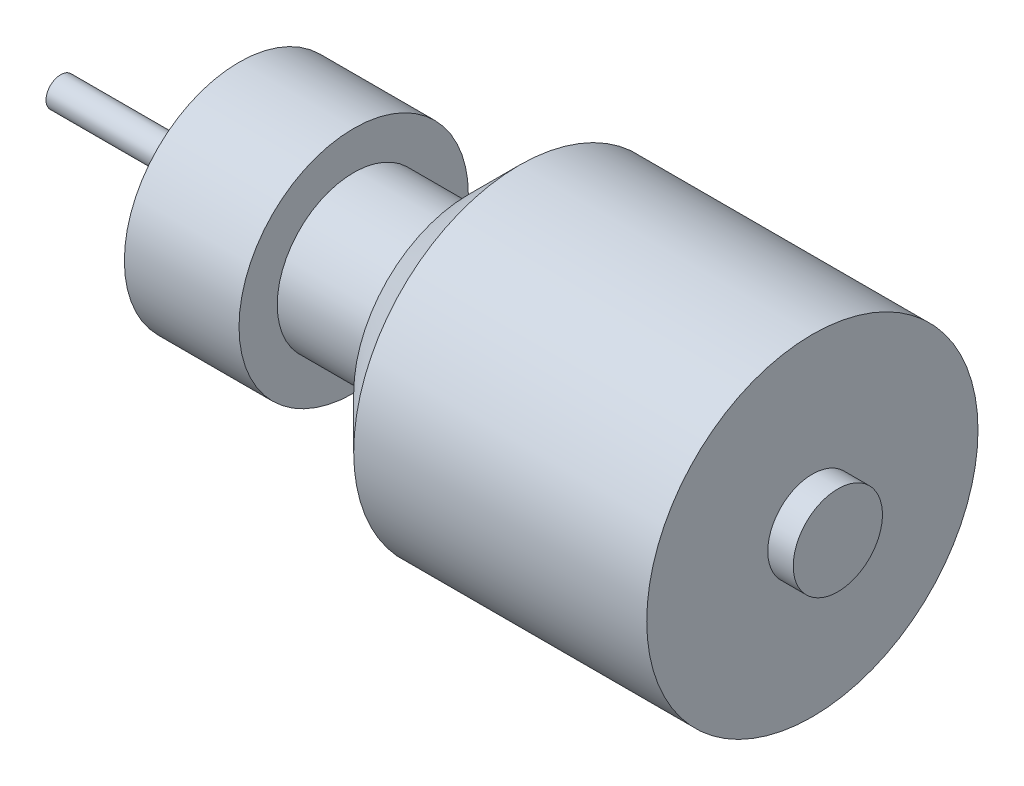
ISO-10303-21;
HEADER;
FILE_DESCRIPTION(('STEP AP214'),'2;1');
FILE_NAME('part.step','',(''),(''),'','','');
FILE_SCHEMA(('AUTOMOTIVE_DESIGN { 1 0 10303 214 1 1 1 1 }'));
ENDSEC;
DATA;
#1=APPLICATION_CONTEXT('core data for automotive mechanical design processes');
#2=APPLICATION_PROTOCOL_DEFINITION('international standard','automotive_design',2000,#1);
#3=PRODUCT_CONTEXT('',#1,'mechanical');
#4=PRODUCT('Part','Part','',(#3));
#5=PRODUCT_RELATED_PRODUCT_CATEGORY('part','',(#4));
#6=PRODUCT_DEFINITION_FORMATION('','',#4);
#7=PRODUCT_DEFINITION_CONTEXT('part definition',#1,'design');
#8=PRODUCT_DEFINITION('design','',#6,#7);
#9=PRODUCT_DEFINITION_SHAPE('','',#8);
#10=(LENGTH_UNIT() NAMED_UNIT(*) SI_UNIT(.MILLI.,.METRE.));
#11=(NAMED_UNIT(*) PLANE_ANGLE_UNIT() SI_UNIT($,.RADIAN.));
#12=(NAMED_UNIT(*) SI_UNIT($,.STERADIAN.) SOLID_ANGLE_UNIT());
#13=UNCERTAINTY_MEASURE_WITH_UNIT(LENGTH_MEASURE(1.E-05),#10,'distance_accuracy_value','');
#14=(GEOMETRIC_REPRESENTATION_CONTEXT(3) GLOBAL_UNCERTAINTY_ASSIGNED_CONTEXT((#13)) GLOBAL_UNIT_ASSIGNED_CONTEXT((#10,
#11,#12)) REPRESENTATION_CONTEXT('',''));
#15=CARTESIAN_POINT('',(0.,0.,0.));
#16=DIRECTION('',(0.,0.,1.));
#17=DIRECTION('',(1.,0.,0.));
#18=AXIS2_PLACEMENT_3D('',#15,#16,#17);
#19=CARTESIAN_POINT('',(-14.,0.,0.));
#20=DIRECTION('',(1.,0.,0.));
#21=DIRECTION('',(0.,0.,-1.));
#22=AXIS2_PLACEMENT_3D('',#19,#20,#21);
#23=PLANE('',#22);
#24=CARTESIAN_POINT('',(-14.,0.,0.));
#25=DIRECTION('',(-1.,0.,0.));
#26=DIRECTION('',(0.,0.,1.));
#27=AXIS2_PLACEMENT_3D('',#24,#25,#26);
#28=CIRCLE('',#27,1.15);
#29=CARTESIAN_POINT('',(-14.,0.,1.15));
#30=VERTEX_POINT('',#29);
#31=EDGE_CURVE('E11',#30,#30,#28,.T.);
#32=ORIENTED_EDGE('',*,*,#31,.T.);
#33=EDGE_LOOP('',(#32));
#34=FACE_BOUND('',#33,.T.);
#35=ADVANCED_FACE('F39',(#34),#23,.F.);
#36=CARTESIAN_POINT('',(-25.8801219816416,0.,0.));
#37=DIRECTION('',(-1.,0.,0.));
#38=DIRECTION('',(0.,0.,1.));
#39=AXIS2_PLACEMENT_3D('',#36,#37,#38);
#40=CYLINDRICAL_SURFACE('',#39,1.15);
#41=ORIENTED_EDGE('',*,*,#31,.F.);
#42=EDGE_LOOP('',(#41));
#43=FACE_BOUND('',#42,.T.);
#44=CARTESIAN_POINT('',(0.,0.,0.));
#45=DIRECTION('',(-1.,0.,0.));
#46=DIRECTION('',(0.,0.,1.));
#47=AXIS2_PLACEMENT_3D('',#44,#45,#46);
#48=CIRCLE('',#47,1.15);
#49=CARTESIAN_POINT('',(0.,0.,1.15));
#50=VERTEX_POINT('',#49);
#51=EDGE_CURVE('E46',#50,#50,#48,.T.);
#52=ORIENTED_EDGE('',*,*,#51,.T.);
#53=EDGE_LOOP('',(#52));
#54=FACE_BOUND('',#53,.T.);
#55=ADVANCED_FACE('F132',(#43,#54),#40,.T.);
#56=CARTESIAN_POINT('',(0.,1.15,0.));
#57=DIRECTION('',(1.,0.,0.));
#58=DIRECTION('',(0.,0.,-1.));
#59=AXIS2_PLACEMENT_3D('',#56,#57,#58);
#60=PLANE('',#59);
#61=CARTESIAN_POINT('',(0.,5.16493505791317,0.));
#62=DIRECTION('',(-1.,0.,0.));
#63=DIRECTION('',(0.,0.,1.));
#64=AXIS2_PLACEMENT_3D('',#61,#62,#63);
#65=CIRCLE('',#64,1.025);
#66=CARTESIAN_POINT('',(0.,5.16493505791317,1.025));
#67=VERTEX_POINT('',#66);
#68=EDGE_CURVE('E76',#67,#67,#65,.T.);
#69=ORIENTED_EDGE('',*,*,#68,.F.);
#70=EDGE_LOOP('',(#69));
#71=FACE_BOUND('',#70,.T.);
#72=CARTESIAN_POINT('',(0.,0.,5.16493505791317));
#73=DIRECTION('',(-1.,0.,0.));
#74=DIRECTION('',(0.,0.,1.));
#75=AXIS2_PLACEMENT_3D('',#72,#73,#74);
#76=CIRCLE('',#75,1.025);
#77=CARTESIAN_POINT('',(0.,0.,6.18993505791317));
#78=VERTEX_POINT('',#77);
#79=EDGE_CURVE('E69',#78,#78,#76,.T.);
#80=ORIENTED_EDGE('',*,*,#79,.F.);
#81=EDGE_LOOP('',(#80));
#82=FACE_BOUND('',#81,.T.);
#83=CARTESIAN_POINT('',(0.,-5.16493505791317,0.));
#84=DIRECTION('',(-1.,0.,0.));
#85=DIRECTION('',(0.,0.,1.));
#86=AXIS2_PLACEMENT_3D('',#83,#84,#85);
#87=CIRCLE('',#86,1.025);
#88=CARTESIAN_POINT('',(0.,-5.16493505791317,1.025));
#89=VERTEX_POINT('',#88);
#90=EDGE_CURVE('E85',#89,#89,#87,.T.);
#91=ORIENTED_EDGE('',*,*,#90,.F.);
#92=EDGE_LOOP('',(#91));
#93=FACE_BOUND('',#92,.T.);
#94=CARTESIAN_POINT('',(0.,0.,-5.16493505791317));
#95=DIRECTION('',(-1.,0.,0.));
#96=DIRECTION('',(0.,0.,1.));
#97=AXIS2_PLACEMENT_3D('',#94,#95,#96);
#98=CIRCLE('',#97,1.025);
#99=CARTESIAN_POINT('',(0.,0.,-4.13993505791317));
#100=VERTEX_POINT('',#99);
#101=EDGE_CURVE('E94',#100,#100,#98,.T.);
#102=ORIENTED_EDGE('',*,*,#101,.F.);
#103=EDGE_LOOP('',(#102));
#104=FACE_BOUND('',#103,.T.);
#105=ORIENTED_EDGE('',*,*,#51,.F.);
#106=EDGE_LOOP('',(#105));
#107=FACE_BOUND('',#106,.T.);
#108=CARTESIAN_POINT('',(0.,0.,0.));
#109=DIRECTION('',(-1.,0.,0.));
#110=DIRECTION('',(0.,0.,1.));
#111=AXIS2_PLACEMENT_3D('',#108,#109,#110);
#112=CIRCLE('',#111,9.);
#113=CARTESIAN_POINT('',(0.,0.,9.));
#114=VERTEX_POINT('',#113);
#115=EDGE_CURVE('E127',#114,#114,#112,.T.);
#116=ORIENTED_EDGE('',*,*,#115,.T.);
#117=EDGE_LOOP('',(#116));
#118=FACE_BOUND('',#117,.T.);
#119=ADVANCED_FACE('F134',(#71,#82,#93,#104,#107,#118),#60,.F.);
#120=CARTESIAN_POINT('',(-25.8801219816416,0.,0.));
#121=DIRECTION('',(-1.,0.,0.));
#122=DIRECTION('',(0.,0.,1.));
#123=AXIS2_PLACEMENT_3D('',#120,#121,#122);
#124=CYLINDRICAL_SURFACE('',#123,9.);
#125=ORIENTED_EDGE('',*,*,#115,.F.);
#126=EDGE_LOOP('',(#125));
#127=FACE_BOUND('',#126,.T.);
#128=CARTESIAN_POINT('',(9.,0.,0.));
#129=DIRECTION('',(-1.,0.,0.));
#130=DIRECTION('',(0.,0.,1.));
#131=AXIS2_PLACEMENT_3D('',#128,#129,#130);
#132=CIRCLE('',#131,9.);
#133=CARTESIAN_POINT('',(9.,0.,9.));
#134=VERTEX_POINT('',#133);
#135=EDGE_CURVE('E124',#134,#134,#132,.T.);
#136=ORIENTED_EDGE('',*,*,#135,.T.);
#137=EDGE_LOOP('',(#136));
#138=FACE_BOUND('',#137,.T.);
#139=ADVANCED_FACE('F137',(#127,#138),#124,.T.);
#140=CARTESIAN_POINT('',(9.,9.,0.));
#141=DIRECTION('',(-1.,0.,0.));
#142=DIRECTION('',(0.,0.,1.));
#143=AXIS2_PLACEMENT_3D('',#140,#141,#142);
#144=PLANE('',#143);
#145=ORIENTED_EDGE('',*,*,#135,.F.);
#146=EDGE_LOOP('',(#145));
#147=FACE_BOUND('',#146,.T.);
#148=CARTESIAN_POINT('',(9.,0.,0.));
#149=DIRECTION('',(-1.,0.,0.));
#150=DIRECTION('',(0.,0.,1.));
#151=AXIS2_PLACEMENT_3D('',#148,#149,#150);
#152=CIRCLE('',#151,6.);
#153=CARTESIAN_POINT('',(9.,0.,6.));
#154=VERTEX_POINT('',#153);
#155=EDGE_CURVE('E121',#154,#154,#152,.T.);
#156=ORIENTED_EDGE('',*,*,#155,.T.);
#157=EDGE_LOOP('',(#156));
#158=FACE_BOUND('',#157,.T.);
#159=ADVANCED_FACE('F144',(#147,#158),#144,.F.);
#160=CARTESIAN_POINT('',(-25.8801219816416,0.,0.));
#161=DIRECTION('',(-1.,0.,0.));
#162=DIRECTION('',(0.,0.,1.));
#163=AXIS2_PLACEMENT_3D('',#160,#161,#162);
#164=CYLINDRICAL_SURFACE('',#163,6.);
#165=ORIENTED_EDGE('',*,*,#155,.F.);
#166=EDGE_LOOP('',(#165));
#167=FACE_BOUND('',#166,.T.);
#168=CARTESIAN_POINT('',(18.,0.,0.));
#169=DIRECTION('',(-1.,0.,0.));
#170=DIRECTION('',(0.,0.,1.));
#171=AXIS2_PLACEMENT_3D('',#168,#169,#170);
#172=CIRCLE('',#171,6.);
#173=CARTESIAN_POINT('',(18.,0.,6.));
#174=VERTEX_POINT('',#173);
#175=EDGE_CURVE('E118',#174,#174,#172,.T.);
#176=ORIENTED_EDGE('',*,*,#175,.T.);
#177=EDGE_LOOP('',(#176));
#178=FACE_BOUND('',#177,.T.);
#179=ADVANCED_FACE('F150',(#167,#178),#164,.T.);
#180=CARTESIAN_POINT('',(18.,6.,0.));
#181=DIRECTION('',(1.,0.,0.));
#182=DIRECTION('',(0.,0.,-1.));
#183=AXIS2_PLACEMENT_3D('',#180,#181,#182);
#184=PLANE('',#183);
#185=ORIENTED_EDGE('',*,*,#175,.F.);
#186=EDGE_LOOP('',(#185));
#187=FACE_BOUND('',#186,.T.);
#188=CARTESIAN_POINT('',(18.,0.,0.));
#189=DIRECTION('',(-1.,0.,0.));
#190=DIRECTION('',(0.,0.,1.));
#191=AXIS2_PLACEMENT_3D('',#188,#189,#190);
#192=CIRCLE('',#191,9.);
#193=CARTESIAN_POINT('',(18.,0.,9.));
#194=VERTEX_POINT('',#193);
#195=EDGE_CURVE('E115',#194,#194,#192,.T.);
#196=ORIENTED_EDGE('',*,*,#195,.T.);
#197=EDGE_LOOP('',(#196));
#198=FACE_BOUND('',#197,.T.);
#199=ADVANCED_FACE('F156',(#187,#198),#184,.F.);
#200=CARTESIAN_POINT('',(22.,0.,0.));
#201=DIRECTION('',(1.,0.,0.));
#202=DIRECTION('',(0.,0.,-1.));
#203=AXIS2_PLACEMENT_3D('',#200,#201,#202);
#204=CONICAL_SURFACE('',#203,13.,0.785398163397449);
#205=ORIENTED_EDGE('',*,*,#195,.F.);
#206=EDGE_LOOP('',(#205));
#207=FACE_BOUND('',#206,.T.);
#208=CARTESIAN_POINT('',(22.,0.,0.));
#209=DIRECTION('',(-1.,0.,0.));
#210=DIRECTION('',(0.,0.,1.));
#211=AXIS2_PLACEMENT_3D('',#208,#209,#210);
#212=CIRCLE('',#211,13.);
#213=CARTESIAN_POINT('',(22.,0.,13.));
#214=VERTEX_POINT('',#213);
#215=EDGE_CURVE('E112',#214,#214,#212,.T.);
#216=ORIENTED_EDGE('',*,*,#215,.T.);
#217=EDGE_LOOP('',(#216));
#218=FACE_BOUND('',#217,.T.);
#219=ADVANCED_FACE('F162',(#207,#218),#204,.T.);
#220=CARTESIAN_POINT('',(-25.8801219816416,0.,0.));
#221=DIRECTION('',(-1.,0.,0.));
#222=DIRECTION('',(0.,0.,1.));
#223=AXIS2_PLACEMENT_3D('',#220,#221,#222);
#224=CYLINDRICAL_SURFACE('',#223,13.);
#225=ORIENTED_EDGE('',*,*,#215,.F.);
#226=EDGE_LOOP('',(#225));
#227=FACE_BOUND('',#226,.T.);
#228=CARTESIAN_POINT('',(45.,0.,0.));
#229=DIRECTION('',(-1.,0.,0.));
#230=DIRECTION('',(0.,0.,1.));
#231=AXIS2_PLACEMENT_3D('',#228,#229,#230);
#232=CIRCLE('',#231,13.);
#233=CARTESIAN_POINT('',(45.,0.,13.));
#234=VERTEX_POINT('',#233);
#235=EDGE_CURVE('E109',#234,#234,#232,.T.);
#236=ORIENTED_EDGE('',*,*,#235,.T.);
#237=EDGE_LOOP('',(#236));
#238=FACE_BOUND('',#237,.T.);
#239=ADVANCED_FACE('F168',(#227,#238),#224,.T.);
#240=CARTESIAN_POINT('',(45.,13.,0.));
#241=DIRECTION('',(-1.,0.,0.));
#242=DIRECTION('',(0.,0.,1.));
#243=AXIS2_PLACEMENT_3D('',#240,#241,#242);
#244=PLANE('',#243);
#245=ORIENTED_EDGE('',*,*,#235,.F.);
#246=EDGE_LOOP('',(#245));
#247=FACE_BOUND('',#246,.T.);
#248=CARTESIAN_POINT('',(45.,0.,0.));
#249=DIRECTION('',(-1.,0.,0.));
#250=DIRECTION('',(0.,0.,1.));
#251=AXIS2_PLACEMENT_3D('',#248,#249,#250);
#252=CIRCLE('',#251,3.5);
#253=CARTESIAN_POINT('',(45.,0.,3.5));
#254=VERTEX_POINT('',#253);
#255=EDGE_CURVE('E106',#254,#254,#252,.T.);
#256=ORIENTED_EDGE('',*,*,#255,.T.);
#257=EDGE_LOOP('',(#256));
#258=FACE_BOUND('',#257,.T.);
#259=ADVANCED_FACE('F174',(#247,#258),#244,.F.);
#260=CARTESIAN_POINT('',(-25.8801219816416,0.,0.));
#261=DIRECTION('',(-1.,0.,0.));
#262=DIRECTION('',(0.,0.,1.));
#263=AXIS2_PLACEMENT_3D('',#260,#261,#262);
#264=CYLINDRICAL_SURFACE('',#263,3.5);
#265=ORIENTED_EDGE('',*,*,#255,.F.);
#266=EDGE_LOOP('',(#265));
#267=FACE_BOUND('',#266,.T.);
#268=CARTESIAN_POINT('',(47.,0.,0.));
#269=DIRECTION('',(-1.,0.,0.));
#270=DIRECTION('',(0.,0.,1.));
#271=AXIS2_PLACEMENT_3D('',#268,#269,#270);
#272=CIRCLE('',#271,3.5);
#273=CARTESIAN_POINT('',(47.,0.,3.5));
#274=VERTEX_POINT('',#273);
#275=EDGE_CURVE('E103',#274,#274,#272,.T.);
#276=ORIENTED_EDGE('',*,*,#275,.T.);
#277=EDGE_LOOP('',(#276));
#278=FACE_BOUND('',#277,.T.);
#279=ADVANCED_FACE('F180',(#267,#278),#264,.T.);
#280=CARTESIAN_POINT('',(47.,3.5,0.));
#281=DIRECTION('',(-1.,0.,0.));
#282=DIRECTION('',(0.,0.,1.));
#283=AXIS2_PLACEMENT_3D('',#280,#281,#282);
#284=PLANE('',#283);
#285=ORIENTED_EDGE('',*,*,#275,.F.);
#286=EDGE_LOOP('',(#285));
#287=FACE_BOUND('',#286,.T.);
#288=ADVANCED_FACE('F186',(#287),#284,.F.);
#289=CARTESIAN_POINT('',(6.,0.,-5.16493505791317));
#290=DIRECTION('',(-1.,0.,0.));
#291=DIRECTION('',(0.,0.,1.));
#292=AXIS2_PLACEMENT_3D('',#289,#290,#291);
#293=CONICAL_SURFACE('',#292,0.799999999999998,1.02974425867665);
#294=CARTESIAN_POINT('',(6.48068849522205,0.,-5.16493505791317));
#295=VERTEX_POINT('',#294);
#296=VERTEX_LOOP('',#295);
#297=FACE_BOUND('',#296,.T.);
#298=CARTESIAN_POINT('',(6.,0.,-5.16493505791317));
#299=DIRECTION('',(-1.,0.,0.));
#300=DIRECTION('',(0.,0.,1.));
#301=AXIS2_PLACEMENT_3D('',#298,#299,#300);
#302=CIRCLE('',#301,0.799999999999998);
#303=CARTESIAN_POINT('',(6.,0.,-4.36493505791317));
#304=VERTEX_POINT('',#303);
#305=EDGE_CURVE('E100',#304,#304,#302,.T.);
#306=ORIENTED_EDGE('',*,*,#305,.T.);
#307=EDGE_LOOP('',(#306));
#308=FACE_BOUND('',#307,.T.);
#309=ADVANCED_FACE('F191',(#297,#308),#293,.F.);
#310=CARTESIAN_POINT('',(0.,0.,-5.16493505791317));
#311=DIRECTION('',(-1.,0.,0.));
#312=DIRECTION('',(0.,0.,1.));
#313=AXIS2_PLACEMENT_3D('',#310,#311,#312);
#314=CYLINDRICAL_SURFACE('',#313,0.799999999999998);
#315=ORIENTED_EDGE('',*,*,#305,.F.);
#316=EDGE_LOOP('',(#315));
#317=FACE_BOUND('',#316,.T.);
#318=CARTESIAN_POINT('',(0.225000000000001,0.,-5.16493505791317));
#319=DIRECTION('',(-1.,0.,0.));
#320=DIRECTION('',(0.,0.,1.));
#321=AXIS2_PLACEMENT_3D('',#318,#319,#320);
#322=CIRCLE('',#321,0.799999999999999);
#323=CARTESIAN_POINT('',(0.225000000000001,0.,-4.36493505791317));
#324=VERTEX_POINT('',#323);
#325=EDGE_CURVE('E97',#324,#324,#322,.T.);
#326=ORIENTED_EDGE('',*,*,#325,.T.);
#327=EDGE_LOOP('',(#326));
#328=FACE_BOUND('',#327,.T.);
#329=ADVANCED_FACE('F196',(#317,#328),#314,.F.);
#330=CARTESIAN_POINT('',(0.,0.,-5.16493505791317));
#331=DIRECTION('',(-1.,0.,0.));
#332=DIRECTION('',(0.,0.,1.));
#333=AXIS2_PLACEMENT_3D('',#330,#331,#332);
#334=CONICAL_SURFACE('',#333,1.025,0.785398163397447);
#335=ORIENTED_EDGE('',*,*,#325,.F.);
#336=EDGE_LOOP('',(#335));
#337=FACE_BOUND('',#336,.T.);
#338=ORIENTED_EDGE('',*,*,#101,.T.);
#339=EDGE_LOOP('',(#338));
#340=FACE_BOUND('',#339,.T.);
#341=ADVANCED_FACE('F262',(#337,#340),#334,.F.);
#342=CARTESIAN_POINT('',(6.,-5.16493505791317,0.));
#343=DIRECTION('',(-1.,0.,0.));
#344=DIRECTION('',(0.,0.,1.));
#345=AXIS2_PLACEMENT_3D('',#342,#343,#344);
#346=CONICAL_SURFACE('',#345,0.799999999999998,1.02974425867665);
#347=CARTESIAN_POINT('',(6.48068849522205,-5.16493505791317,0.));
#348=VERTEX_POINT('',#347);
#349=VERTEX_LOOP('',#348);
#350=FACE_BOUND('',#349,.T.);
#351=CARTESIAN_POINT('',(6.,-5.16493505791317,0.));
#352=DIRECTION('',(-1.,0.,0.));
#353=DIRECTION('',(0.,0.,1.));
#354=AXIS2_PLACEMENT_3D('',#351,#352,#353);
#355=CIRCLE('',#354,0.799999999999998);
#356=CARTESIAN_POINT('',(6.,-5.16493505791317,0.799999999999998));
#357=VERTEX_POINT('',#356);
#358=EDGE_CURVE('E91',#357,#357,#355,.T.);
#359=ORIENTED_EDGE('',*,*,#358,.T.);
#360=EDGE_LOOP('',(#359));
#361=FACE_BOUND('',#360,.T.);
#362=ADVANCED_FACE('F272',(#350,#361),#346,.F.);
#363=CARTESIAN_POINT('',(0.,-5.16493505791317,0.));
#364=DIRECTION('',(-1.,0.,0.));
#365=DIRECTION('',(0.,0.,1.));
#366=AXIS2_PLACEMENT_3D('',#363,#364,#365);
#367=CYLINDRICAL_SURFACE('',#366,0.799999999999999);
#368=ORIENTED_EDGE('',*,*,#358,.F.);
#369=EDGE_LOOP('',(#368));
#370=FACE_BOUND('',#369,.T.);
#371=CARTESIAN_POINT('',(0.225000000000001,-5.16493505791317,0.));
#372=DIRECTION('',(-1.,0.,0.));
#373=DIRECTION('',(0.,0.,1.));
#374=AXIS2_PLACEMENT_3D('',#371,#372,#373);
#375=CIRCLE('',#374,0.799999999999999);
#376=CARTESIAN_POINT('',(0.225000000000001,-5.16493505791317,0.799999999999999));
#377=VERTEX_POINT('',#376);
#378=EDGE_CURVE('E88',#377,#377,#375,.T.);
#379=ORIENTED_EDGE('',*,*,#378,.T.);
#380=EDGE_LOOP('',(#379));
#381=FACE_BOUND('',#380,.T.);
#382=ADVANCED_FACE('F281',(#370,#381),#367,.F.);
#383=CARTESIAN_POINT('',(0.,-5.16493505791317,0.));
#384=DIRECTION('',(-1.,0.,0.));
#385=DIRECTION('',(0.,0.,1.));
#386=AXIS2_PLACEMENT_3D('',#383,#384,#385);
#387=CONICAL_SURFACE('',#386,1.025,0.785398163397446);
#388=ORIENTED_EDGE('',*,*,#378,.F.);
#389=EDGE_LOOP('',(#388));
#390=FACE_BOUND('',#389,.T.);
#391=ORIENTED_EDGE('',*,*,#90,.T.);
#392=EDGE_LOOP('',(#391));
#393=FACE_BOUND('',#392,.T.);
#394=ADVANCED_FACE('F289',(#390,#393),#387,.F.);
#395=CARTESIAN_POINT('',(6.,0.,5.16493505791317));
#396=DIRECTION('',(-1.,0.,0.));
#397=DIRECTION('',(0.,0.,1.));
#398=AXIS2_PLACEMENT_3D('',#395,#396,#397);
#399=CONICAL_SURFACE('',#398,0.799999999999998,1.02974425867665);
#400=CARTESIAN_POINT('',(6.48068849522205,0.,5.16493505791317));
#401=VERTEX_POINT('',#400);
#402=VERTEX_LOOP('',#401);
#403=FACE_BOUND('',#402,.T.);
#404=CARTESIAN_POINT('',(6.,0.,5.16493505791317));
#405=DIRECTION('',(-1.,0.,0.));
#406=DIRECTION('',(0.,0.,1.));
#407=AXIS2_PLACEMENT_3D('',#404,#405,#406);
#408=CIRCLE('',#407,0.799999999999998);
#409=CARTESIAN_POINT('',(6.,0.,5.96493505791316));
#410=VERTEX_POINT('',#409);
#411=EDGE_CURVE('E82',#410,#410,#408,.T.);
#412=ORIENTED_EDGE('',*,*,#411,.T.);
#413=EDGE_LOOP('',(#412));
#414=FACE_BOUND('',#413,.T.);
#415=ADVANCED_FACE('F299',(#403,#414),#399,.F.);
#416=CARTESIAN_POINT('',(0.,0.,5.16493505791317));
#417=DIRECTION('',(-1.,0.,0.));
#418=DIRECTION('',(0.,0.,1.));
#419=AXIS2_PLACEMENT_3D('',#416,#417,#418);
#420=CYLINDRICAL_SURFACE('',#419,0.799999999999998);
#421=ORIENTED_EDGE('',*,*,#411,.F.);
#422=EDGE_LOOP('',(#421));
#423=FACE_BOUND('',#422,.T.);
#424=CARTESIAN_POINT('',(0.225000000000001,0.,5.16493505791317));
#425=DIRECTION('',(-1.,0.,0.));
#426=DIRECTION('',(0.,0.,1.));
#427=AXIS2_PLACEMENT_3D('',#424,#425,#426);
#428=CIRCLE('',#427,0.799999999999999);
#429=CARTESIAN_POINT('',(0.225000000000001,0.,5.96493505791317));
#430=VERTEX_POINT('',#429);
#431=EDGE_CURVE('E73',#430,#430,#428,.T.);
#432=ORIENTED_EDGE('',*,*,#431,.T.);
#433=EDGE_LOOP('',(#432));
#434=FACE_BOUND('',#433,.T.);
#435=ADVANCED_FACE('F308',(#423,#434),#420,.F.);
#436=CARTESIAN_POINT('',(0.,0.,5.16493505791317));
#437=DIRECTION('',(-1.,0.,0.));
#438=DIRECTION('',(0.,0.,1.));
#439=AXIS2_PLACEMENT_3D('',#436,#437,#438);
#440=CONICAL_SURFACE('',#439,1.025,0.785398163397447);
#441=ORIENTED_EDGE('',*,*,#431,.F.);
#442=EDGE_LOOP('',(#441));
#443=FACE_BOUND('',#442,.T.);
#444=ORIENTED_EDGE('',*,*,#79,.T.);
#445=EDGE_LOOP('',(#444));
#446=FACE_BOUND('',#445,.T.);
#447=ADVANCED_FACE('F63',(#443,#446),#440,.F.);
#448=CARTESIAN_POINT('',(6.,5.16493505791317,0.));
#449=DIRECTION('',(-1.,0.,0.));
#450=DIRECTION('',(0.,0.,1.));
#451=AXIS2_PLACEMENT_3D('',#448,#449,#450);
#452=CONICAL_SURFACE('',#451,0.799999999999998,1.02974425867665);
#453=CARTESIAN_POINT('',(6.48068849522205,5.16493505791317,0.));
#454=VERTEX_POINT('',#453);
#455=VERTEX_LOOP('',#454);
#456=FACE_BOUND('',#455,.T.);
#457=CARTESIAN_POINT('',(6.,5.16493505791317,0.));
#458=DIRECTION('',(-1.,0.,0.));
#459=DIRECTION('',(0.,0.,1.));
#460=AXIS2_PLACEMENT_3D('',#457,#458,#459);
#461=CIRCLE('',#460,0.799999999999998);
#462=CARTESIAN_POINT('',(6.,5.16493505791317,0.799999999999998));
#463=VERTEX_POINT('',#462);
#464=EDGE_CURVE('E67',#463,#463,#461,.T.);
#465=ORIENTED_EDGE('',*,*,#464,.T.);
#466=EDGE_LOOP('',(#465));
#467=FACE_BOUND('',#466,.T.);
#468=ADVANCED_FACE('F59',(#456,#467),#452,.F.);
#469=CARTESIAN_POINT('',(0.,5.16493505791317,0.));
#470=DIRECTION('',(-1.,0.,0.));
#471=DIRECTION('',(0.,0.,1.));
#472=AXIS2_PLACEMENT_3D('',#469,#470,#471);
#473=CYLINDRICAL_SURFACE('',#472,0.799999999999999);
#474=ORIENTED_EDGE('',*,*,#464,.F.);
#475=EDGE_LOOP('',(#474));
#476=FACE_BOUND('',#475,.T.);
#477=CARTESIAN_POINT('',(0.225000000000001,5.16493505791317,0.));
#478=DIRECTION('',(-1.,0.,0.));
#479=DIRECTION('',(0.,0.,1.));
#480=AXIS2_PLACEMENT_3D('',#477,#478,#479);
#481=CIRCLE('',#480,0.799999999999999);
#482=CARTESIAN_POINT('',(0.225000000000001,5.16493505791317,0.799999999999999));
#483=VERTEX_POINT('',#482);
#484=EDGE_CURVE('E70',#483,#483,#481,.T.);
#485=ORIENTED_EDGE('',*,*,#484,.T.);
#486=EDGE_LOOP('',(#485));
#487=FACE_BOUND('',#486,.T.);
#488=ADVANCED_FACE('F62',(#476,#487),#473,.F.);
#489=CARTESIAN_POINT('',(0.,5.16493505791317,0.));
#490=DIRECTION('',(-1.,0.,0.));
#491=DIRECTION('',(0.,0.,1.));
#492=AXIS2_PLACEMENT_3D('',#489,#490,#491);
#493=CONICAL_SURFACE('',#492,1.025,0.785398163397446);
#494=ORIENTED_EDGE('',*,*,#484,.F.);
#495=EDGE_LOOP('',(#494));
#496=FACE_BOUND('',#495,.T.);
#497=ORIENTED_EDGE('',*,*,#68,.T.);
#498=EDGE_LOOP('',(#497));
#499=FACE_BOUND('',#498,.T.);
#500=ADVANCED_FACE('F339',(#496,#499),#493,.F.);
#501=CLOSED_SHELL('',(#35,#55,#119,#139,#159,#179,#199,#219,#239,#259,#279,#288,#309,#329,#341,
#362,#382,#394,#415,#435,#447,#468,#488,#500));
#502=MANIFOLD_SOLID_BREP('B2',#501);
#503=ADVANCED_BREP_SHAPE_REPRESENTATION('',(#18,#502),#14);
#504=SHAPE_DEFINITION_REPRESENTATION(#9,#503);
ENDSEC;
END-ISO-10303-21;
